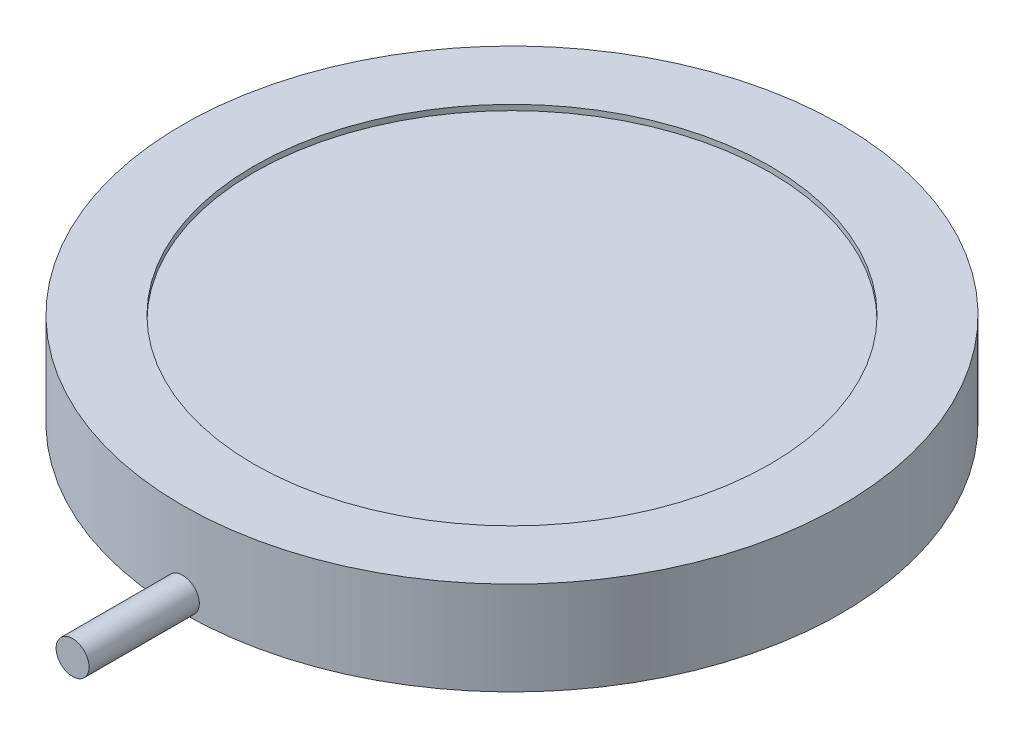
ISO-10303-21;
HEADER;
FILE_DESCRIPTION(('STEP AP214'),'2;1');
FILE_NAME('part.step','',(''),(''),'','','');
FILE_SCHEMA(('AUTOMOTIVE_DESIGN { 1 0 10303 214 1 1 1 1 }'));
ENDSEC;
DATA;
#1=APPLICATION_CONTEXT('core data for automotive mechanical design processes');
#2=APPLICATION_PROTOCOL_DEFINITION('international standard','automotive_design',2000,#1);
#3=PRODUCT_CONTEXT('',#1,'mechanical');
#4=PRODUCT('Part','Part','',(#3));
#5=PRODUCT_RELATED_PRODUCT_CATEGORY('part','',(#4));
#6=PRODUCT_DEFINITION_FORMATION('','',#4);
#7=PRODUCT_DEFINITION_CONTEXT('part definition',#1,'design');
#8=PRODUCT_DEFINITION('design','',#6,#7);
#9=PRODUCT_DEFINITION_SHAPE('','',#8);
#10=(LENGTH_UNIT() NAMED_UNIT(*) SI_UNIT(.MILLI.,.METRE.));
#11=(NAMED_UNIT(*) PLANE_ANGLE_UNIT() SI_UNIT($,.RADIAN.));
#12=(NAMED_UNIT(*) SI_UNIT($,.STERADIAN.) SOLID_ANGLE_UNIT());
#13=UNCERTAINTY_MEASURE_WITH_UNIT(LENGTH_MEASURE(1.E-05),#10,'distance_accuracy_value','');
#14=(GEOMETRIC_REPRESENTATION_CONTEXT(3) GLOBAL_UNCERTAINTY_ASSIGNED_CONTEXT((#13)) GLOBAL_UNIT_ASSIGNED_CONTEXT((#10,
#11,#12)) REPRESENTATION_CONTEXT('',''));
#15=CARTESIAN_POINT('',(0.,0.,0.));
#16=DIRECTION('',(0.,0.,1.));
#17=DIRECTION('',(1.,0.,0.));
#18=AXIS2_PLACEMENT_3D('',#15,#16,#17);
#19=CARTESIAN_POINT('',(0.,8.5,0.));
#20=DIRECTION('',(0.,-1.,0.));
#21=DIRECTION('',(0.,0.,-1.));
#22=AXIS2_PLACEMENT_3D('',#19,#20,#21);
#23=CYLINDRICAL_SURFACE('',#22,30.);
#24=CARTESIAN_POINT('',(0.,8.5,0.));
#25=DIRECTION('',(0.,1.,0.));
#26=DIRECTION('',(0.,0.,1.));
#27=AXIS2_PLACEMENT_3D('',#24,#25,#26);
#28=CIRCLE('',#27,30.);
#29=CARTESIAN_POINT('',(0.,8.5,30.));
#30=VERTEX_POINT('',#29);
#31=EDGE_CURVE('E11',#30,#30,#28,.T.);
#32=ORIENTED_EDGE('',*,*,#31,.F.);
#33=EDGE_LOOP('',(#32));
#34=FACE_BOUND('',#33,.T.);
#35=CARTESIAN_POINT('',(0.,0.,0.));
#36=DIRECTION('',(0.,1.,0.));
#37=DIRECTION('',(0.,0.,1.));
#38=AXIS2_PLACEMENT_3D('',#35,#36,#37);
#39=CIRCLE('',#38,30.);
#40=CARTESIAN_POINT('',(0.,0.,30.));
#41=VERTEX_POINT('',#40);
#42=EDGE_CURVE('E47',#41,#41,#39,.T.);
#43=ORIENTED_EDGE('',*,*,#42,.T.);
#44=CARTESIAN_POINT('',(-1.5,1.5,29.9624765331573));
#45=CARTESIAN_POINT('',(-1.49999628397222,1.41580086150497,29.9624770372162));
#46=CARTESIAN_POINT('',(-1.49288669377387,1.33154201127373,29.962835266608));
#47=CARTESIAN_POINT('',(-1.46462595928152,1.16534872152329,29.9642297287393));
#48=CARTESIAN_POINT('',(-1.44345827052283,1.08341713949153,29.9652667603156));
#49=CARTESIAN_POINT('',(-1.38768891775242,0.92430991251044,29.9679010652108));
#50=CARTESIAN_POINT('',(-1.35309410203283,0.847131866309445,29.9694980528928));
#51=CARTESIAN_POINT('',(-1.271463027665,0.699699226520033,29.9730719610605));
#52=CARTESIAN_POINT('',(-1.22442970578001,0.629443004038358,29.975048791834));
#53=CARTESIAN_POINT('',(-1.11920369397771,0.497756287823946,29.9791619233031));
#54=CARTESIAN_POINT('',(-1.06100115527481,0.436333667630866,29.9812983637162));
#55=CARTESIAN_POINT('',(-0.93510853867131,0.324124841403367,29.985488661235));
#56=CARTESIAN_POINT('',(-0.867418073690438,0.273339069532905,29.9875425149671));
#57=CARTESIAN_POINT('',(-0.724430010979663,0.183823995657181,29.9913372650751));
#58=CARTESIAN_POINT('',(-0.649128580822738,0.14510080811049,29.9930780025459));
#59=CARTESIAN_POINT('',(-0.493083104497864,0.0808493607007044,29.9960489494894));
#60=CARTESIAN_POINT('',(-0.412339099524104,0.0553210009802309,29.9972791628257));
#61=CARTESIAN_POINT('',(-0.247772768188906,0.0182046138266745,29.9990894967281));
#62=CARTESIAN_POINT('',(-0.163953098728566,0.00660483340008613,29.9996701653544));
#63=CARTESIAN_POINT('',(0.00444557228202945,-0.00236139043343335,30.0001178121798));
#64=CARTESIAN_POINT('',(0.0890245678515665,0.000272054151776845,29.9999847959953));
#65=CARTESIAN_POINT('',(0.256461420139639,0.0196877720201725,29.9990205243754));
#66=CARTESIAN_POINT('',(0.339320747918154,0.036457394502543,29.9981898932546));
#67=CARTESIAN_POINT('',(0.501046790855103,0.0836498297544425,29.9959246714313));
#68=CARTESIAN_POINT('',(0.579913489272554,0.114072699766383,29.9944900781967));
#69=CARTESIAN_POINT('',(0.731456268769945,0.187722460127962,29.991177454681));
#70=CARTESIAN_POINT('',(0.804129544029278,0.230955114435468,29.9892992248562));
#71=CARTESIAN_POINT('',(0.941191880683595,0.328993016353595,29.9853108458067));
#72=CARTESIAN_POINT('',(1.00558088357129,0.383798345688472,29.9832006949442));
#73=CARTESIAN_POINT('',(1.12432069061591,0.503497393741378,29.978983382249));
#74=CARTESIAN_POINT('',(1.178660431069,0.568402088315336,29.9768762262153));
#75=CARTESIAN_POINT('',(1.27567397617904,0.706418901437198,29.9729047794271));
#76=CARTESIAN_POINT('',(1.31834777773623,0.77953102216589,29.9710404887371));
#77=CARTESIAN_POINT('',(1.39081712539269,0.931893978985675,29.9677651844501));
#78=CARTESIAN_POINT('',(1.42061225547781,1.01114501328194,29.966354185496));
#79=CARTESIAN_POINT('',(1.46647109571372,1.17353313415029,29.9641451427563));
#80=CARTESIAN_POINT('',(1.48253490913895,1.2566701914903,29.9633470943607));
#81=CARTESIAN_POINT('',(1.50046143951967,1.42437402449913,29.9624548008175));
#82=CARTESIAN_POINT('',(1.50233951237468,1.50893915484596,29.9623597946373));
#83=CARTESIAN_POINT('',(1.49188132304581,1.67718335516849,29.9628823125091));
#84=CARTESIAN_POINT('',(1.47954510786832,1.76086242807344,29.9634998342048));
#85=CARTESIAN_POINT('',(1.44102125848948,1.92491603574536,29.9653771125877));
#86=CARTESIAN_POINT('',(1.41484065287852,2.00529222504216,29.9666365433754));
#87=CARTESIAN_POINT('',(1.34937830775901,2.16050944662125,29.9696554135577));
#88=CARTESIAN_POINT('',(1.31009649243498,2.23535044686884,29.9714148558457));
#89=CARTESIAN_POINT('',(1.21950738416592,2.37744347447921,29.9752372960101));
#90=CARTESIAN_POINT('',(1.16818977630626,2.44468891864549,29.9773005536947));
#91=CARTESIAN_POINT('',(1.05500087152025,2.56961576124229,29.981497160644));
#92=CARTESIAN_POINT('',(0.993129507121334,2.62729709852266,29.9836305103568));
#93=CARTESIAN_POINT('',(0.860523436418344,2.73150996656878,29.9877290769785));
#94=CARTESIAN_POINT('',(0.789780929636859,2.77803157830691,29.9896941433233));
#95=CARTESIAN_POINT('',(0.641480125358402,2.85853660637076,29.9932325258126));
#96=CARTESIAN_POINT('',(0.563921857527848,2.89252007726689,29.994805843662));
#97=CARTESIAN_POINT('',(0.40422802456372,2.94696681430624,29.9973826962819));
#98=CARTESIAN_POINT('',(0.322094627416059,2.96743642605679,29.9983864984446));
#99=CARTESIAN_POINT('',(0.155551644264921,2.99429516866115,29.9997122550948));
#100=CARTESIAN_POINT('',(0.0711420711067388,3.00068437895899,30.0000342134294));
#101=CARTESIAN_POINT('',(-0.097458732341275,2.99920019243027,29.9999600152463));
#102=CARTESIAN_POINT('',(-0.181650100387104,2.9913423547829,29.999564642125));
#103=CARTESIAN_POINT('',(-0.347516717827453,2.96161929049812,29.9981018331539));
#104=CARTESIAN_POINT('',(-0.429191962482231,2.93975403747596,29.9970343960382));
#105=CARTESIAN_POINT('',(-0.587711133113285,2.88263999847476,29.9943475524905));
#106=CARTESIAN_POINT('',(-0.664555023593041,2.84739111417801,29.9927281420037));
#107=CARTESIAN_POINT('',(-0.81123505466916,2.76451310399524,29.9891194758232));
#108=CARTESIAN_POINT('',(-0.88107141029245,2.71688435814766,29.9871302314832));
#109=CARTESIAN_POINT('',(-1.01183168334708,2.61054295234161,29.9830033176299));
#110=CARTESIAN_POINT('',(-1.07274677865547,2.55181945055255,29.9808655042371));
#111=CARTESIAN_POINT('',(-1.18387304623982,2.42496252168575,29.9766833697048));
#112=CARTESIAN_POINT('',(-1.23408158124698,2.35682678295532,29.9746390716975));
#113=CARTESIAN_POINT('',(-1.32239306067115,2.21302589093276,29.9708731658307));
#114=CARTESIAN_POINT('',(-1.3604843396651,2.13735357354026,29.9691518695786));
#115=CARTESIAN_POINT('',(-1.42337565004508,1.98073568310982,29.9662310322912));
#116=CARTESIAN_POINT('',(-1.44819138081059,1.89979646627244,29.9650308752857));
#117=CARTESIAN_POINT('',(-1.4773179225833,1.7652953083114,29.9636054274165));
#118=CARTESIAN_POINT('',(-1.48581284214325,1.71260455931175,29.9631839590812));
#119=CARTESIAN_POINT('',(-1.49715505505153,1.60661718854603,29.9626193524688));
#120=CARTESIAN_POINT('',(-1.50000235323915,1.55332056729914,29.9624762139532));
#121=CARTESIAN_POINT('',(-1.5,1.5,29.9624765331573));
#122=B_SPLINE_CURVE_WITH_KNOTS('',3,(#44,#45,#46,#47,#48,#49,#50,#51,#52,#53,#54,#55,#56,#57,
#58,#59,#60,#61,#62,#63,#64,#65,#66,#67,#68,#69,#70,#71,#72,#73,#74,#75,#76,#77,#78,#79,#80,#81,
#82,#83,#84,#85,#86,#87,#88,#89,#90,#91,#92,#93,#94,#95,#96,#97,#98,#99,#100,#101,#102,#103,
#104,#105,#106,#107,#108,#109,#110,#111,#112,#113,#114,#115,#116,#117,#118,#119,#120,#121),
.UNSPECIFIED.,.T.,.F.,(4,2,2,2,2,2,2,2,2,2,2,2,2,2,2,2,2,2,2,2,2,2,2,2,2,2,2,2,2,2,2,2,2,2,2,2,
2,2,4),(0.,0.252402774850886,0.505103120966064,0.757674750307552,1.01018679999478,
1.2629225413087,1.5156685965212,1.76854255964547,2.02141460901224,2.27407313360386,
2.52672966991109,2.77916033764388,3.03159206372378,3.28413754825082,3.53668481627066,
3.78950849136503,4.04233223363706,4.29516414215493,4.54799414908479,4.80055043119032,
5.05310587809922,5.30553322930184,5.55796204130353,5.81060798549992,6.06325554497973,
6.3161268383656,6.5689970311533,6.82174840085849,7.0744983444935,7.32697242654597,
7.57944698416684,7.83192339653088,8.08439205925959,8.33710872331969,8.589887565506,
8.84290902947146,9.0956306104889,9.25546918978481,9.415307632119),.UNSPECIFIED.);
#123=EDGE_CURVE('E64',#41,#41,#122,.T.);
#124=ORIENTED_EDGE('',*,*,#123,.F.);
#125=EDGE_LOOP('',(#43,#124));
#126=FACE_BOUND('',#125,.T.);
#127=ADVANCED_FACE('F43',(#34,#126),#23,.T.);
#128=CARTESIAN_POINT('',(0.,8.5,0.));
#129=DIRECTION('',(0.,1.,0.));
#130=DIRECTION('',(0.,0.,1.));
#131=AXIS2_PLACEMENT_3D('',#128,#129,#130);
#132=PLANE('',#131);
#133=CARTESIAN_POINT('',(0.,8.5,0.));
#134=DIRECTION('',(0.,1.,0.));
#135=DIRECTION('',(0.,0.,1.));
#136=AXIS2_PLACEMENT_3D('',#133,#134,#135);
#137=CIRCLE('',#136,23.5);
#138=CARTESIAN_POINT('',(0.,8.5,23.5));
#139=VERTEX_POINT('',#138);
#140=EDGE_CURVE('E59',#139,#139,#137,.T.);
#141=ORIENTED_EDGE('',*,*,#140,.F.);
#142=EDGE_LOOP('',(#141));
#143=FACE_BOUND('',#142,.T.);
#144=ORIENTED_EDGE('',*,*,#31,.T.);
#145=EDGE_LOOP('',(#144));
#146=FACE_BOUND('',#145,.T.);
#147=ADVANCED_FACE('F90',(#143,#146),#132,.T.);
#148=CARTESIAN_POINT('',(0.,0.,0.));
#149=DIRECTION('',(0.,1.,0.));
#150=DIRECTION('',(0.,0.,1.));
#151=AXIS2_PLACEMENT_3D('',#148,#149,#150);
#152=PLANE('',#151);
#153=CARTESIAN_POINT('',(-14.,0.,0.));
#154=DIRECTION('',(0.,-1.,0.));
#155=DIRECTION('',(0.,0.,-1.));
#156=AXIS2_PLACEMENT_3D('',#153,#154,#155);
#157=CIRCLE('',#156,1.75);
#158=CARTESIAN_POINT('',(-14.,0.,-1.75));
#159=VERTEX_POINT('',#158);
#160=EDGE_CURVE('E182',#159,#159,#157,.T.);
#161=ORIENTED_EDGE('',*,*,#160,.F.);
#162=EDGE_LOOP('',(#161));
#163=FACE_BOUND('',#162,.T.);
#164=CARTESIAN_POINT('',(14.,0.,0.));
#165=DIRECTION('',(0.,-1.,0.));
#166=DIRECTION('',(0.,0.,-1.));
#167=AXIS2_PLACEMENT_3D('',#164,#165,#166);
#168=CIRCLE('',#167,1.75);
#169=CARTESIAN_POINT('',(14.,0.,-1.74999999999999));
#170=VERTEX_POINT('',#169);
#171=EDGE_CURVE('E186',#170,#170,#168,.T.);
#172=ORIENTED_EDGE('',*,*,#171,.F.);
#173=EDGE_LOOP('',(#172));
#174=FACE_BOUND('',#173,.T.);
#175=ORIENTED_EDGE('',*,*,#42,.F.);
#176=EDGE_LOOP('',(#175));
#177=FACE_BOUND('',#176,.T.);
#178=ADVANCED_FACE('F54',(#163,#174,#177),#152,.F.);
#179=CARTESIAN_POINT('',(0.,8.,0.));
#180=DIRECTION('',(0.,1.,0.));
#181=DIRECTION('',(0.,0.,1.));
#182=AXIS2_PLACEMENT_3D('',#179,#180,#181);
#183=CYLINDRICAL_SURFACE('',#182,23.5);
#184=CARTESIAN_POINT('',(0.,8.,0.));
#185=DIRECTION('',(0.,1.,0.));
#186=DIRECTION('',(0.,0.,1.));
#187=AXIS2_PLACEMENT_3D('',#184,#185,#186);
#188=CIRCLE('',#187,23.5);
#189=CARTESIAN_POINT('',(0.,8.,23.5));
#190=VERTEX_POINT('',#189);
#191=EDGE_CURVE('E57',#190,#190,#188,.T.);
#192=ORIENTED_EDGE('',*,*,#191,.F.);
#193=EDGE_LOOP('',(#192));
#194=FACE_BOUND('',#193,.T.);
#195=ORIENTED_EDGE('',*,*,#140,.T.);
#196=EDGE_LOOP('',(#195));
#197=FACE_BOUND('',#196,.T.);
#198=ADVANCED_FACE('F86',(#194,#197),#183,.F.);
#199=CARTESIAN_POINT('',(0.,8.,0.));
#200=DIRECTION('',(0.,1.,0.));
#201=DIRECTION('',(0.,0.,1.));
#202=AXIS2_PLACEMENT_3D('',#199,#200,#201);
#203=PLANE('',#202);
#204=ORIENTED_EDGE('',*,*,#191,.T.);
#205=EDGE_LOOP('',(#204));
#206=FACE_BOUND('',#205,.T.);
#207=ADVANCED_FACE('F81',(#206),#203,.T.);
#208=CARTESIAN_POINT('',(0.,1.5,40.));
#209=DIRECTION('',(0.,0.,-1.));
#210=DIRECTION('',(-1.,0.,0.));
#211=AXIS2_PLACEMENT_3D('',#208,#209,#210);
#212=CYLINDRICAL_SURFACE('',#211,1.5);
#213=CARTESIAN_POINT('',(0.,1.5,40.));
#214=DIRECTION('',(0.,0.,1.));
#215=DIRECTION('',(1.,0.,0.));
#216=AXIS2_PLACEMENT_3D('',#213,#214,#215);
#217=CIRCLE('',#216,1.5);
#218=CARTESIAN_POINT('',(1.5,1.5,40.));
#219=VERTEX_POINT('',#218);
#220=EDGE_CURVE('E73',#219,#219,#217,.T.);
#221=ORIENTED_EDGE('',*,*,#220,.F.);
#222=EDGE_LOOP('',(#221));
#223=FACE_BOUND('',#222,.T.);
#224=ORIENTED_EDGE('',*,*,#123,.T.);
#225=EDGE_LOOP('',(#224));
#226=FACE_BOUND('',#225,.T.);
#227=ADVANCED_FACE('F75',(#223,#226),#212,.T.);
#228=CARTESIAN_POINT('',(0.,1.5,40.));
#229=DIRECTION('',(0.,0.,1.));
#230=DIRECTION('',(1.,0.,0.));
#231=AXIS2_PLACEMENT_3D('',#228,#229,#230);
#232=PLANE('',#231);
#233=ORIENTED_EDGE('',*,*,#220,.T.);
#234=EDGE_LOOP('',(#233));
#235=FACE_BOUND('',#234,.T.);
#236=ADVANCED_FACE('F80',(#235),#232,.T.);
#237=CARTESIAN_POINT('',(14.,3.,0.));
#238=DIRECTION('',(0.,-1.,0.));
#239=DIRECTION('',(0.,0.,-1.));
#240=AXIS2_PLACEMENT_3D('',#237,#238,#239);
#241=CYLINDRICAL_SURFACE('',#240,1.75);
#242=CARTESIAN_POINT('',(14.,3.,0.));
#243=DIRECTION('',(0.,-1.,0.));
#244=DIRECTION('',(0.,0.,-1.));
#245=AXIS2_PLACEMENT_3D('',#242,#243,#244);
#246=CIRCLE('',#245,1.75);
#247=CARTESIAN_POINT('',(14.,3.,-1.74999999999999));
#248=VERTEX_POINT('',#247);
#249=EDGE_CURVE('E190',#248,#248,#246,.T.);
#250=ORIENTED_EDGE('',*,*,#249,.F.);
#251=EDGE_LOOP('',(#250));
#252=FACE_BOUND('',#251,.T.);
#253=ORIENTED_EDGE('',*,*,#171,.T.);
#254=EDGE_LOOP('',(#253));
#255=FACE_BOUND('',#254,.T.);
#256=ADVANCED_FACE('F126',(#252,#255),#241,.F.);
#257=CARTESIAN_POINT('',(14.,3.,0.));
#258=DIRECTION('',(0.,-1.,0.));
#259=DIRECTION('',(0.,0.,-1.));
#260=AXIS2_PLACEMENT_3D('',#257,#258,#259);
#261=PLANE('',#260);
#262=ORIENTED_EDGE('',*,*,#249,.T.);
#263=EDGE_LOOP('',(#262));
#264=FACE_BOUND('',#263,.T.);
#265=ADVANCED_FACE('F136',(#264),#261,.T.);
#266=CARTESIAN_POINT('',(-14.,3.,0.));
#267=DIRECTION('',(0.,-1.,0.));
#268=DIRECTION('',(0.,0.,-1.));
#269=AXIS2_PLACEMENT_3D('',#266,#267,#268);
#270=CYLINDRICAL_SURFACE('',#269,1.75);
#271=CARTESIAN_POINT('',(-14.,3.,0.));
#272=DIRECTION('',(0.,-1.,0.));
#273=DIRECTION('',(0.,0.,-1.));
#274=AXIS2_PLACEMENT_3D('',#271,#272,#273);
#275=CIRCLE('',#274,1.75);
#276=CARTESIAN_POINT('',(-14.,3.,-1.75));
#277=VERTEX_POINT('',#276);
#278=EDGE_CURVE('E181',#277,#277,#275,.T.);
#279=ORIENTED_EDGE('',*,*,#278,.F.);
#280=EDGE_LOOP('',(#279));
#281=FACE_BOUND('',#280,.T.);
#282=ORIENTED_EDGE('',*,*,#160,.T.);
#283=EDGE_LOOP('',(#282));
#284=FACE_BOUND('',#283,.T.);
#285=ADVANCED_FACE('F143',(#281,#284),#270,.F.);
#286=CARTESIAN_POINT('',(-14.,3.,0.));
#287=DIRECTION('',(0.,-1.,0.));
#288=DIRECTION('',(0.,0.,-1.));
#289=AXIS2_PLACEMENT_3D('',#286,#287,#288);
#290=PLANE('',#289);
#291=ORIENTED_EDGE('',*,*,#278,.T.);
#292=EDGE_LOOP('',(#291));
#293=FACE_BOUND('',#292,.T.);
#294=ADVANCED_FACE('F150',(#293),#290,.T.);
#295=CLOSED_SHELL('',(#127,#147,#178,#198,#207,#227,#236,#256,#265,#285,#294));
#296=MANIFOLD_SOLID_BREP('B2',#295);
#297=ADVANCED_BREP_SHAPE_REPRESENTATION('',(#18,#296),#14);
#298=SHAPE_DEFINITION_REPRESENTATION(#9,#297);
ENDSEC;
END-ISO-10303-21;
